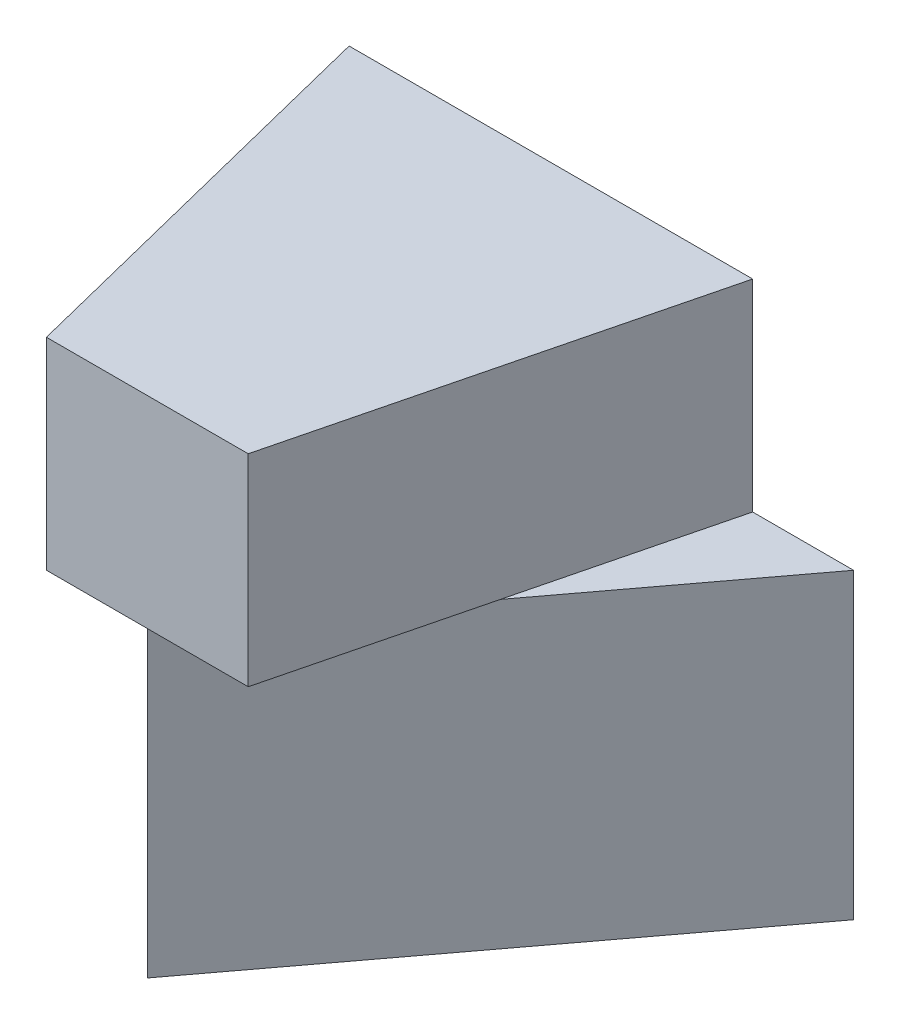
ISO-10303-21;
HEADER;
FILE_DESCRIPTION(('STEP AP214'),'2;1');
FILE_NAME('part.step','',(''),(''),'','','');
FILE_SCHEMA(('AUTOMOTIVE_DESIGN { 1 0 10303 214 1 1 1 1 }'));
ENDSEC;
DATA;
#1=APPLICATION_CONTEXT('core data for automotive mechanical design processes');
#2=APPLICATION_PROTOCOL_DEFINITION('international standard','automotive_design',2000,#1);
#3=PRODUCT_CONTEXT('',#1,'mechanical');
#4=PRODUCT('Part','Part','',(#3));
#5=PRODUCT_RELATED_PRODUCT_CATEGORY('part','',(#4));
#6=PRODUCT_DEFINITION_FORMATION('','',#4);
#7=PRODUCT_DEFINITION_CONTEXT('part definition',#1,'design');
#8=PRODUCT_DEFINITION('design','',#6,#7);
#9=PRODUCT_DEFINITION_SHAPE('','',#8);
#10=(LENGTH_UNIT() NAMED_UNIT(*) SI_UNIT(.MILLI.,.METRE.));
#11=(NAMED_UNIT(*) PLANE_ANGLE_UNIT() SI_UNIT($,.RADIAN.));
#12=(NAMED_UNIT(*) SI_UNIT($,.STERADIAN.) SOLID_ANGLE_UNIT());
#13=UNCERTAINTY_MEASURE_WITH_UNIT(LENGTH_MEASURE(1.E-05),#10,'distance_accuracy_value','');
#14=(GEOMETRIC_REPRESENTATION_CONTEXT(3) GLOBAL_UNCERTAINTY_ASSIGNED_CONTEXT((#13)) GLOBAL_UNIT_ASSIGNED_CONTEXT((#10,
#11,#12)) REPRESENTATION_CONTEXT('',''));
#15=CARTESIAN_POINT('',(0.,0.,0.));
#16=DIRECTION('',(0.,0.,1.));
#17=DIRECTION('',(1.,0.,0.));
#18=AXIS2_PLACEMENT_3D('',#15,#16,#17);
#19=CARTESIAN_POINT('',(0.,3.,0.));
#20=DIRECTION('',(0.,-1.,0.));
#21=DIRECTION('',(0.,0.,-1.));
#22=AXIS2_PLACEMENT_3D('',#19,#20,#21);
#23=PLANE('',#22);
#24=DIRECTION('',(0.242535625036333,0.,0.970142500145332));
#25=VECTOR('',#24,1.);
#26=CARTESIAN_POINT('',(-1.,3.,0.));
#27=LINE('',#26,#25);
#28=CARTESIAN_POINT('',(-2.,3.,-4.));
#29=VERTEX_POINT('',#28);
#30=CARTESIAN_POINT('',(-1.5,3.,-2.));
#31=VERTEX_POINT('',#30);
#32=EDGE_CURVE('E57',#29,#31,#27,.T.);
#33=ORIENTED_EDGE('',*,*,#32,.F.);
#34=DIRECTION('',(-1.,0.,0.));
#35=VECTOR('',#34,1.);
#36=CARTESIAN_POINT('',(-3.,3.,-4.));
#37=LINE('',#36,#35);
#38=CARTESIAN_POINT('',(-3.,3.,-4.));
#39=VERTEX_POINT('',#38);
#40=EDGE_CURVE('E139',#29,#39,#37,.T.);
#41=ORIENTED_EDGE('',*,*,#40,.T.);
#42=DIRECTION('',(0.6,0.,0.8));
#43=VECTOR('',#42,1.);
#44=CARTESIAN_POINT('',(0.,3.,0.));
#45=LINE('',#44,#43);
#46=EDGE_CURVE('E143',#39,#31,#45,.T.);
#47=ORIENTED_EDGE('',*,*,#46,.T.);
#48=EDGE_LOOP('',(#33,#41,#47));
#49=FACE_BOUND('',#48,.T.);
#50=ADVANCED_FACE('F33',(#49),#23,.F.);
#51=DIRECTION('',(0.242535625036333,0.,-0.970142500145332));
#52=VECTOR('',#51,1.);
#53=CARTESIAN_POINT('',(2.,3.,-4.));
#54=LINE('',#53,#52);
#55=CARTESIAN_POINT('',(1.5,3.,-2.));
#56=VERTEX_POINT('',#55);
#57=CARTESIAN_POINT('',(2.,3.,-4.));
#58=VERTEX_POINT('',#57);
#59=EDGE_CURVE('E11',#56,#58,#54,.T.);
#60=ORIENTED_EDGE('',*,*,#59,.F.);
#61=DIRECTION('',(0.6,0.,-0.8));
#62=VECTOR('',#61,1.);
#63=CARTESIAN_POINT('',(3.,3.,-4.));
#64=LINE('',#63,#62);
#65=CARTESIAN_POINT('',(3.,3.,-4.));
#66=VERTEX_POINT('',#65);
#67=EDGE_CURVE('E140',#56,#66,#64,.T.);
#68=ORIENTED_EDGE('',*,*,#67,.T.);
#69=EDGE_CURVE('E147',#66,#58,#37,.T.);
#70=ORIENTED_EDGE('',*,*,#69,.T.);
#71=EDGE_LOOP('',(#60,#68,#70));
#72=FACE_BOUND('',#71,.T.);
#73=ADVANCED_FACE('F197',(#72),#23,.F.);
#74=CARTESIAN_POINT('',(3.,3.,-4.));
#75=DIRECTION('',(-0.8,0.,-0.6));
#76=DIRECTION('',(-0.6,0.,0.8));
#77=AXIS2_PLACEMENT_3D('',#74,#75,#76);
#78=PLANE('',#77);
#79=DIRECTION('',(0.6,0.,-0.8));
#80=VECTOR('',#79,1.);
#81=CARTESIAN_POINT('',(3.,0.,-4.));
#82=LINE('',#81,#80);
#83=CARTESIAN_POINT('',(0.,0.,0.));
#84=VERTEX_POINT('',#83);
#85=CARTESIAN_POINT('',(3.,0.,-4.));
#86=VERTEX_POINT('',#85);
#87=EDGE_CURVE('E127',#84,#86,#82,.T.);
#88=ORIENTED_EDGE('',*,*,#87,.T.);
#89=DIRECTION('',(0.,-1.,0.));
#90=VECTOR('',#89,1.);
#91=CARTESIAN_POINT('',(3.,3.,-4.));
#92=LINE('',#91,#90);
#93=EDGE_CURVE('E42',#66,#86,#92,.T.);
#94=ORIENTED_EDGE('',*,*,#93,.F.);
#95=ORIENTED_EDGE('',*,*,#67,.F.);
#96=CARTESIAN_POINT('',(0.,3.,0.));
#97=VERTEX_POINT('',#96);
#98=EDGE_CURVE('E136',#97,#56,#64,.T.);
#99=ORIENTED_EDGE('',*,*,#98,.F.);
#100=DIRECTION('',(0.,-1.,0.));
#101=VECTOR('',#100,1.);
#102=CARTESIAN_POINT('',(0.,3.,0.));
#103=LINE('',#102,#101);
#104=EDGE_CURVE('E154',#97,#84,#103,.T.);
#105=ORIENTED_EDGE('',*,*,#104,.T.);
#106=EDGE_LOOP('',(#88,#94,#95,#99,#105));
#107=FACE_BOUND('',#106,.T.);
#108=ADVANCED_FACE('F35',(#107),#78,.F.);
#109=CARTESIAN_POINT('',(-3.,3.,-4.));
#110=DIRECTION('',(0.,0.,1.));
#111=DIRECTION('',(1.,0.,0.));
#112=AXIS2_PLACEMENT_3D('',#109,#110,#111);
#113=PLANE('',#112);
#114=DIRECTION('',(-1.,0.,0.));
#115=VECTOR('',#114,1.);
#116=CARTESIAN_POINT('',(-3.,0.,-4.));
#117=LINE('',#116,#115);
#118=CARTESIAN_POINT('',(-3.,0.,-4.));
#119=VERTEX_POINT('',#118);
#120=EDGE_CURVE('E130',#86,#119,#117,.T.);
#121=ORIENTED_EDGE('',*,*,#120,.T.);
#122=DIRECTION('',(0.,-1.,0.));
#123=VECTOR('',#122,1.);
#124=CARTESIAN_POINT('',(-3.,3.,-4.));
#125=LINE('',#124,#123);
#126=EDGE_CURVE('E151',#39,#119,#125,.T.);
#127=ORIENTED_EDGE('',*,*,#126,.F.);
#128=ORIENTED_EDGE('',*,*,#40,.F.);
#129=DIRECTION('',(0.,-1.,0.));
#130=VECTOR('',#129,1.);
#131=CARTESIAN_POINT('',(-2.,5.,-4.));
#132=LINE('',#131,#130);
#133=CARTESIAN_POINT('',(-2.,5.,-4.));
#134=VERTEX_POINT('',#133);
#135=EDGE_CURVE('E189',#134,#29,#132,.T.);
#136=ORIENTED_EDGE('',*,*,#135,.F.);
#137=DIRECTION('',(-1.,0.,0.));
#138=VECTOR('',#137,1.);
#139=CARTESIAN_POINT('',(-2.,5.,-4.));
#140=LINE('',#139,#138);
#141=CARTESIAN_POINT('',(2.,5.,-4.));
#142=VERTEX_POINT('',#141);
#143=EDGE_CURVE('E117',#142,#134,#140,.T.);
#144=ORIENTED_EDGE('',*,*,#143,.F.);
#145=DIRECTION('',(0.,-1.,0.));
#146=VECTOR('',#145,1.);
#147=CARTESIAN_POINT('',(2.,5.,-4.));
#148=LINE('',#147,#146);
#149=EDGE_CURVE('E132',#142,#58,#148,.T.);
#150=ORIENTED_EDGE('',*,*,#149,.T.);
#151=ORIENTED_EDGE('',*,*,#69,.F.);
#152=ORIENTED_EDGE('',*,*,#93,.T.);
#153=EDGE_LOOP('',(#121,#127,#128,#136,#144,#150,#151,#152));
#154=FACE_BOUND('',#153,.T.);
#155=ADVANCED_FACE('F161',(#154),#113,.F.);
#156=CARTESIAN_POINT('',(0.,3.,0.));
#157=DIRECTION('',(0.8,0.,-0.6));
#158=DIRECTION('',(-0.6,0.,-0.8));
#159=AXIS2_PLACEMENT_3D('',#156,#157,#158);
#160=PLANE('',#159);
#161=DIRECTION('',(0.6,0.,0.8));
#162=VECTOR('',#161,1.);
#163=CARTESIAN_POINT('',(0.,0.,0.));
#164=LINE('',#163,#162);
#165=EDGE_CURVE('E157',#119,#84,#164,.T.);
#166=ORIENTED_EDGE('',*,*,#165,.T.);
#167=ORIENTED_EDGE('',*,*,#104,.F.);
#168=EDGE_CURVE('E50',#31,#97,#45,.T.);
#169=ORIENTED_EDGE('',*,*,#168,.F.);
#170=ORIENTED_EDGE('',*,*,#46,.F.);
#171=ORIENTED_EDGE('',*,*,#126,.T.);
#172=EDGE_LOOP('',(#166,#167,#169,#170,#171));
#173=FACE_BOUND('',#172,.T.);
#174=ADVANCED_FACE('F167',(#173),#160,.F.);
#175=CARTESIAN_POINT('',(0.,0.,0.));
#176=DIRECTION('',(0.,-1.,0.));
#177=DIRECTION('',(0.,0.,-1.));
#178=AXIS2_PLACEMENT_3D('',#175,#176,#177);
#179=PLANE('',#178);
#180=ORIENTED_EDGE('',*,*,#87,.F.);
#181=ORIENTED_EDGE('',*,*,#165,.F.);
#182=ORIENTED_EDGE('',*,*,#120,.F.);
#183=EDGE_LOOP('',(#180,#181,#182));
#184=FACE_BOUND('',#183,.T.);
#185=ADVANCED_FACE('F168',(#184),#179,.T.);
#186=CARTESIAN_POINT('',(0.,3.,0.));
#187=DIRECTION('',(0.,-1.,0.));
#188=DIRECTION('',(0.,0.,-1.));
#189=AXIS2_PLACEMENT_3D('',#186,#187,#188);
#190=PLANE('',#189);
#191=DIRECTION('',(1.,0.,0.));
#192=VECTOR('',#191,1.);
#193=CARTESIAN_POINT('',(1.,3.,0.));
#194=LINE('',#193,#192);
#195=CARTESIAN_POINT('',(1.,3.,0.));
#196=VERTEX_POINT('',#195);
#197=EDGE_CURVE('E179',#97,#196,#194,.T.);
#198=ORIENTED_EDGE('',*,*,#197,.F.);
#199=ORIENTED_EDGE('',*,*,#98,.T.);
#200=EDGE_CURVE('E121',#196,#56,#54,.T.);
#201=ORIENTED_EDGE('',*,*,#200,.F.);
#202=EDGE_LOOP('',(#198,#199,#201));
#203=FACE_BOUND('',#202,.T.);
#204=ADVANCED_FACE('F180',(#203),#190,.T.);
#205=CARTESIAN_POINT('',(-1.,5.,0.));
#206=DIRECTION('',(0.970142500145332,0.,-0.242535625036333));
#207=DIRECTION('',(-0.242535625036333,0.,-0.970142500145332));
#208=AXIS2_PLACEMENT_3D('',#205,#206,#207);
#209=PLANE('',#208);
#210=ORIENTED_EDGE('',*,*,#32,.T.);
#211=CARTESIAN_POINT('',(-1.,3.,0.));
#212=VERTEX_POINT('',#211);
#213=EDGE_CURVE('E125',#31,#212,#27,.T.);
#214=ORIENTED_EDGE('',*,*,#213,.T.);
#215=DIRECTION('',(0.,-1.,0.));
#216=VECTOR('',#215,1.);
#217=CARTESIAN_POINT('',(-1.,5.,0.));
#218=LINE('',#217,#216);
#219=CARTESIAN_POINT('',(-1.,5.,0.));
#220=VERTEX_POINT('',#219);
#221=EDGE_CURVE('E106',#220,#212,#218,.T.);
#222=ORIENTED_EDGE('',*,*,#221,.F.);
#223=DIRECTION('',(0.242535625036333,0.,0.970142500145332));
#224=VECTOR('',#223,1.);
#225=CARTESIAN_POINT('',(-1.,5.,0.));
#226=LINE('',#225,#224);
#227=EDGE_CURVE('E112',#134,#220,#226,.T.);
#228=ORIENTED_EDGE('',*,*,#227,.F.);
#229=ORIENTED_EDGE('',*,*,#135,.T.);
#230=EDGE_LOOP('',(#210,#214,#222,#228,#229));
#231=FACE_BOUND('',#230,.T.);
#232=ADVANCED_FACE('F123',(#231),#209,.F.);
#233=CARTESIAN_POINT('',(1.,5.,0.));
#234=DIRECTION('',(0.,0.,-1.));
#235=DIRECTION('',(-1.,0.,0.));
#236=AXIS2_PLACEMENT_3D('',#233,#234,#235);
#237=PLANE('',#236);
#238=EDGE_CURVE('E178',#212,#97,#194,.T.);
#239=ORIENTED_EDGE('',*,*,#238,.T.);
#240=ORIENTED_EDGE('',*,*,#197,.T.);
#241=DIRECTION('',(0.,-1.,0.));
#242=VECTOR('',#241,1.);
#243=CARTESIAN_POINT('',(1.,5.,0.));
#244=LINE('',#243,#242);
#245=CARTESIAN_POINT('',(1.,5.,0.));
#246=VERTEX_POINT('',#245);
#247=EDGE_CURVE('E108',#246,#196,#244,.T.);
#248=ORIENTED_EDGE('',*,*,#247,.F.);
#249=DIRECTION('',(1.,0.,0.));
#250=VECTOR('',#249,1.);
#251=CARTESIAN_POINT('',(1.,5.,0.));
#252=LINE('',#251,#250);
#253=EDGE_CURVE('E101',#220,#246,#252,.T.);
#254=ORIENTED_EDGE('',*,*,#253,.F.);
#255=ORIENTED_EDGE('',*,*,#221,.T.);
#256=EDGE_LOOP('',(#239,#240,#248,#254,#255));
#257=FACE_BOUND('',#256,.T.);
#258=ADVANCED_FACE('F104',(#257),#237,.F.);
#259=CARTESIAN_POINT('',(2.,5.,-4.));
#260=DIRECTION('',(-0.970142500145332,0.,-0.242535625036333));
#261=DIRECTION('',(-0.242535625036333,0.,0.970142500145332));
#262=AXIS2_PLACEMENT_3D('',#259,#260,#261);
#263=PLANE('',#262);
#264=ORIENTED_EDGE('',*,*,#200,.T.);
#265=ORIENTED_EDGE('',*,*,#59,.T.);
#266=ORIENTED_EDGE('',*,*,#149,.F.);
#267=DIRECTION('',(0.242535625036333,0.,-0.970142500145332));
#268=VECTOR('',#267,1.);
#269=CARTESIAN_POINT('',(2.,5.,-4.));
#270=LINE('',#269,#268);
#271=EDGE_CURVE('E111',#246,#142,#270,.T.);
#272=ORIENTED_EDGE('',*,*,#271,.F.);
#273=ORIENTED_EDGE('',*,*,#247,.T.);
#274=EDGE_LOOP('',(#264,#265,#266,#272,#273));
#275=FACE_BOUND('',#274,.T.);
#276=ADVANCED_FACE('F195',(#275),#263,.F.);
#277=CARTESIAN_POINT('',(0.,5.,0.));
#278=DIRECTION('',(0.,-1.,0.));
#279=DIRECTION('',(0.,0.,-1.));
#280=AXIS2_PLACEMENT_3D('',#277,#278,#279);
#281=PLANE('',#280);
#282=ORIENTED_EDGE('',*,*,#227,.T.);
#283=ORIENTED_EDGE('',*,*,#253,.T.);
#284=ORIENTED_EDGE('',*,*,#271,.T.);
#285=ORIENTED_EDGE('',*,*,#143,.T.);
#286=EDGE_LOOP('',(#282,#283,#284,#285));
#287=FACE_BOUND('',#286,.T.);
#288=ADVANCED_FACE('F115',(#287),#281,.F.);
#289=ORIENTED_EDGE('',*,*,#213,.F.);
#290=ORIENTED_EDGE('',*,*,#168,.T.);
#291=ORIENTED_EDGE('',*,*,#238,.F.);
#292=EDGE_LOOP('',(#289,#290,#291));
#293=FACE_BOUND('',#292,.T.);
#294=ADVANCED_FACE('F177',(#293),#190,.T.);
#295=CLOSED_SHELL('',(#50,#73,#108,#155,#174,#185,#204,#232,#258,#276,#288,#294));
#296=MANIFOLD_SOLID_BREP('B2',#295);
#297=ADVANCED_BREP_SHAPE_REPRESENTATION('',(#18,#296),#14);
#298=SHAPE_DEFINITION_REPRESENTATION(#9,#297);
ENDSEC;
END-ISO-10303-21;
